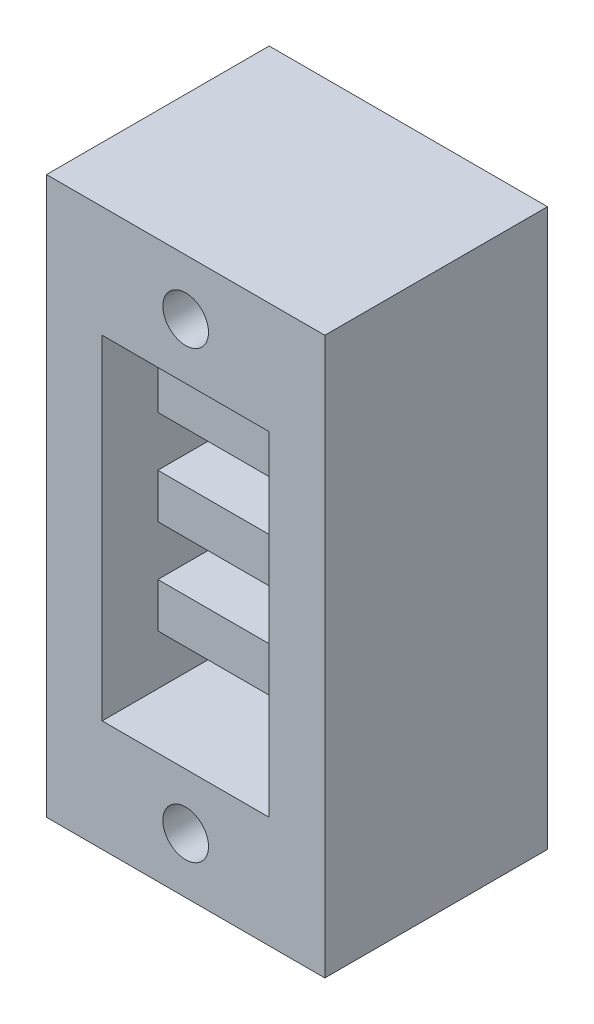
ISO-10303-21;
HEADER;
FILE_DESCRIPTION(('STEP AP214'),'2;1');
FILE_NAME('part.step','',(''),(''),'','','');
FILE_SCHEMA(('AUTOMOTIVE_DESIGN { 1 0 10303 214 1 1 1 1 }'));
ENDSEC;
DATA;
#1=APPLICATION_CONTEXT('core data for automotive mechanical design processes');
#2=APPLICATION_PROTOCOL_DEFINITION('international standard','automotive_design',2000,#1);
#3=PRODUCT_CONTEXT('',#1,'mechanical');
#4=PRODUCT('Part','Part','',(#3));
#5=PRODUCT_RELATED_PRODUCT_CATEGORY('part','',(#4));
#6=PRODUCT_DEFINITION_FORMATION('','',#4);
#7=PRODUCT_DEFINITION_CONTEXT('part definition',#1,'design');
#8=PRODUCT_DEFINITION('design','',#6,#7);
#9=PRODUCT_DEFINITION_SHAPE('','',#8);
#10=(LENGTH_UNIT() NAMED_UNIT(*) SI_UNIT(.MILLI.,.METRE.));
#11=(NAMED_UNIT(*) PLANE_ANGLE_UNIT() SI_UNIT($,.RADIAN.));
#12=(NAMED_UNIT(*) SI_UNIT($,.STERADIAN.) SOLID_ANGLE_UNIT());
#13=UNCERTAINTY_MEASURE_WITH_UNIT(LENGTH_MEASURE(1.E-05),#10,'distance_accuracy_value','');
#14=(GEOMETRIC_REPRESENTATION_CONTEXT(3) GLOBAL_UNCERTAINTY_ASSIGNED_CONTEXT((#13)) GLOBAL_UNIT_ASSIGNED_CONTEXT((#10,
#11,#12)) REPRESENTATION_CONTEXT('',''));
#15=CARTESIAN_POINT('',(0.,0.,0.));
#16=DIRECTION('',(0.,0.,1.));
#17=DIRECTION('',(1.,0.,0.));
#18=AXIS2_PLACEMENT_3D('',#15,#16,#17);
#19=CARTESIAN_POINT('',(-3.81,5.08,-22.1188379885484));
#20=DIRECTION('',(-1.,0.,0.));
#21=DIRECTION('',(0.,0.,1.));
#22=AXIS2_PLACEMENT_3D('',#19,#20,#21);
#23=PLANE('',#22);
#24=DIRECTION('',(0.,0.,1.));
#25=VECTOR('',#24,1.);
#26=CARTESIAN_POINT('',(-3.81,16.002,-2.54));
#27=LINE('',#26,#25);
#28=CARTESIAN_POINT('',(-3.81,16.002,-2.54));
#29=VERTEX_POINT('',#28);
#30=CARTESIAN_POINT('',(-3.81,16.002,2.54));
#31=VERTEX_POINT('',#30);
#32=EDGE_CURVE('E239',#29,#31,#27,.T.);
#33=ORIENTED_EDGE('',*,*,#32,.T.);
#34=DIRECTION('',(0.,1.,0.));
#35=VECTOR('',#34,1.);
#36=CARTESIAN_POINT('',(-3.81,16.002,2.54));
#37=LINE('',#36,#35);
#38=CARTESIAN_POINT('',(-3.81,18.034,2.54));
#39=VERTEX_POINT('',#38);
#40=EDGE_CURVE('E234',#31,#39,#37,.T.);
#41=ORIENTED_EDGE('',*,*,#40,.T.);
#42=DIRECTION('',(0.,0.,-1.));
#43=VECTOR('',#42,1.);
#44=CARTESIAN_POINT('',(-3.81,18.034,-2.54));
#45=LINE('',#44,#43);
#46=CARTESIAN_POINT('',(-3.81,18.034,-2.54));
#47=VERTEX_POINT('',#46);
#48=EDGE_CURVE('E222',#39,#47,#45,.T.);
#49=ORIENTED_EDGE('',*,*,#48,.T.);
#50=DIRECTION('',(0.,1.,0.));
#51=VECTOR('',#50,1.);
#52=CARTESIAN_POINT('',(-3.81,5.08,-2.54));
#53=LINE('',#52,#51);
#54=CARTESIAN_POINT('',(-3.81,20.32,-2.54));
#55=VERTEX_POINT('',#54);
#56=EDGE_CURVE('E330',#47,#55,#53,.T.);
#57=ORIENTED_EDGE('',*,*,#56,.T.);
#58=DIRECTION('',(0.,0.,1.));
#59=VECTOR('',#58,1.);
#60=CARTESIAN_POINT('',(-3.81,20.32,-22.1188379885484));
#61=LINE('',#60,#59);
#62=CARTESIAN_POINT('',(-3.81,20.32,5.08));
#63=VERTEX_POINT('',#62);
#64=EDGE_CURVE('E347',#55,#63,#61,.T.);
#65=ORIENTED_EDGE('',*,*,#64,.T.);
#66=DIRECTION('',(0.,-1.,0.));
#67=VECTOR('',#66,1.);
#68=CARTESIAN_POINT('',(-3.81,5.08,5.08));
#69=LINE('',#68,#67);
#70=CARTESIAN_POINT('',(-3.81,5.08,5.08));
#71=VERTEX_POINT('',#70);
#72=EDGE_CURVE('E187',#63,#71,#69,.T.);
#73=ORIENTED_EDGE('',*,*,#72,.T.);
#74=DIRECTION('',(0.,0.,1.));
#75=VECTOR('',#74,1.);
#76=CARTESIAN_POINT('',(-3.81,5.08,-22.1188379885484));
#77=LINE('',#76,#75);
#78=CARTESIAN_POINT('',(-3.81,5.08,-5.08));
#79=VERTEX_POINT('',#78);
#80=EDGE_CURVE('E180',#79,#71,#77,.T.);
#81=ORIENTED_EDGE('',*,*,#80,.F.);
#82=DIRECTION('',(0.,-1.,0.));
#83=VECTOR('',#82,1.);
#84=CARTESIAN_POINT('',(-3.81,7.366,-5.08));
#85=LINE('',#84,#83);
#86=CARTESIAN_POINT('',(-3.81,7.366,-5.08));
#87=VERTEX_POINT('',#86);
#88=EDGE_CURVE('E184',#87,#79,#85,.T.);
#89=ORIENTED_EDGE('',*,*,#88,.F.);
#90=DIRECTION('',(0.,0.,1.));
#91=VECTOR('',#90,1.);
#92=CARTESIAN_POINT('',(-3.81,7.366,-2.54));
#93=LINE('',#92,#91);
#94=CARTESIAN_POINT('',(-3.81,7.366,2.54));
#95=VERTEX_POINT('',#94);
#96=EDGE_CURVE('E272',#87,#95,#93,.T.);
#97=ORIENTED_EDGE('',*,*,#96,.T.);
#98=DIRECTION('',(0.,1.,0.));
#99=VECTOR('',#98,1.);
#100=CARTESIAN_POINT('',(-3.81,9.398,2.54));
#101=LINE('',#100,#99);
#102=CARTESIAN_POINT('',(-3.81,9.398,2.54));
#103=VERTEX_POINT('',#102);
#104=EDGE_CURVE('E267',#95,#103,#101,.T.);
#105=ORIENTED_EDGE('',*,*,#104,.T.);
#106=DIRECTION('',(0.,0.,-1.));
#107=VECTOR('',#106,1.);
#108=CARTESIAN_POINT('',(-3.81,9.398,-2.54));
#109=LINE('',#108,#107);
#110=CARTESIAN_POINT('',(-3.81,9.398,-2.54));
#111=VERTEX_POINT('',#110);
#112=EDGE_CURVE('E256',#103,#111,#109,.T.);
#113=ORIENTED_EDGE('',*,*,#112,.T.);
#114=CARTESIAN_POINT('',(-3.81,11.684,-2.54));
#115=VERTEX_POINT('',#114);
#116=EDGE_CURVE('E334',#111,#115,#53,.T.);
#117=ORIENTED_EDGE('',*,*,#116,.T.);
#118=DIRECTION('',(0.,0.,1.));
#119=VECTOR('',#118,1.);
#120=CARTESIAN_POINT('',(-3.81,11.684,-2.54));
#121=LINE('',#120,#119);
#122=CARTESIAN_POINT('',(-3.81,11.684,2.54));
#123=VERTEX_POINT('',#122);
#124=EDGE_CURVE('E305',#115,#123,#121,.T.);
#125=ORIENTED_EDGE('',*,*,#124,.T.);
#126=DIRECTION('',(0.,1.,0.));
#127=VECTOR('',#126,1.);
#128=CARTESIAN_POINT('',(-3.81,13.716,2.54));
#129=LINE('',#128,#127);
#130=CARTESIAN_POINT('',(-3.81,13.716,2.54));
#131=VERTEX_POINT('',#130);
#132=EDGE_CURVE('E301',#123,#131,#129,.T.);
#133=ORIENTED_EDGE('',*,*,#132,.T.);
#134=DIRECTION('',(0.,0.,-1.));
#135=VECTOR('',#134,1.);
#136=CARTESIAN_POINT('',(-3.81,13.716,-2.54));
#137=LINE('',#136,#135);
#138=CARTESIAN_POINT('',(-3.81,13.716,-2.54));
#139=VERTEX_POINT('',#138);
#140=EDGE_CURVE('E289',#131,#139,#137,.T.);
#141=ORIENTED_EDGE('',*,*,#140,.T.);
#142=EDGE_CURVE('E333',#139,#29,#53,.T.);
#143=ORIENTED_EDGE('',*,*,#142,.T.);
#144=EDGE_LOOP('',(#33,#41,#49,#57,#65,#73,#81,#89,#97,#105,#113,#117,#125,#133,#141,#143));
#145=FACE_BOUND('',#144,.T.);
#146=ADVANCED_FACE('F41',(#145),#23,.F.);
#147=CARTESIAN_POINT('',(3.81,5.08,-22.1188379885484));
#148=DIRECTION('',(1.,0.,0.));
#149=DIRECTION('',(0.,0.,-1.));
#150=AXIS2_PLACEMENT_3D('',#147,#148,#149);
#151=PLANE('',#150);
#152=DIRECTION('',(0.,0.,1.));
#153=VECTOR('',#152,1.);
#154=CARTESIAN_POINT('',(3.81,16.002,-2.54));
#155=LINE('',#154,#153);
#156=CARTESIAN_POINT('',(3.81,16.002,-2.54));
#157=VERTEX_POINT('',#156);
#158=CARTESIAN_POINT('',(3.81,16.002,2.54));
#159=VERTEX_POINT('',#158);
#160=EDGE_CURVE('E229',#157,#159,#155,.T.);
#161=ORIENTED_EDGE('',*,*,#160,.F.);
#162=DIRECTION('',(0.,-1.,0.));
#163=VECTOR('',#162,1.);
#164=CARTESIAN_POINT('',(3.81,5.08,-2.54));
#165=LINE('',#164,#163);
#166=CARTESIAN_POINT('',(3.81,13.716,-2.54));
#167=VERTEX_POINT('',#166);
#168=EDGE_CURVE('E326',#157,#167,#165,.T.);
#169=ORIENTED_EDGE('',*,*,#168,.T.);
#170=DIRECTION('',(0.,0.,-1.));
#171=VECTOR('',#170,1.);
#172=CARTESIAN_POINT('',(3.81,13.716,-2.54));
#173=LINE('',#172,#171);
#174=CARTESIAN_POINT('',(3.81,13.716,2.54));
#175=VERTEX_POINT('',#174);
#176=EDGE_CURVE('E285',#175,#167,#173,.T.);
#177=ORIENTED_EDGE('',*,*,#176,.F.);
#178=DIRECTION('',(0.,1.,0.));
#179=VECTOR('',#178,1.);
#180=CARTESIAN_POINT('',(3.81,13.716,2.54));
#181=LINE('',#180,#179);
#182=CARTESIAN_POINT('',(3.81,11.684,2.54));
#183=VERTEX_POINT('',#182);
#184=EDGE_CURVE('E291',#183,#175,#181,.T.);
#185=ORIENTED_EDGE('',*,*,#184,.F.);
#186=DIRECTION('',(0.,0.,1.));
#187=VECTOR('',#186,1.);
#188=CARTESIAN_POINT('',(3.81,11.684,-2.54));
#189=LINE('',#188,#187);
#190=CARTESIAN_POINT('',(3.81,11.684,-2.54));
#191=VERTEX_POINT('',#190);
#192=EDGE_CURVE('E296',#191,#183,#189,.T.);
#193=ORIENTED_EDGE('',*,*,#192,.F.);
#194=CARTESIAN_POINT('',(3.81,9.398,-2.54));
#195=VERTEX_POINT('',#194);
#196=EDGE_CURVE('E327',#191,#195,#165,.T.);
#197=ORIENTED_EDGE('',*,*,#196,.T.);
#198=DIRECTION('',(0.,0.,-1.));
#199=VECTOR('',#198,1.);
#200=CARTESIAN_POINT('',(3.81,9.398,-2.54));
#201=LINE('',#200,#199);
#202=CARTESIAN_POINT('',(3.81,9.398,2.54));
#203=VERTEX_POINT('',#202);
#204=EDGE_CURVE('E253',#203,#195,#201,.T.);
#205=ORIENTED_EDGE('',*,*,#204,.F.);
#206=DIRECTION('',(0.,1.,0.));
#207=VECTOR('',#206,1.);
#208=CARTESIAN_POINT('',(3.81,9.398,2.54));
#209=LINE('',#208,#207);
#210=CARTESIAN_POINT('',(3.81,7.366,2.54));
#211=VERTEX_POINT('',#210);
#212=EDGE_CURVE('E258',#211,#203,#209,.T.);
#213=ORIENTED_EDGE('',*,*,#212,.F.);
#214=DIRECTION('',(0.,0.,1.));
#215=VECTOR('',#214,1.);
#216=CARTESIAN_POINT('',(3.81,7.366,-2.54));
#217=LINE('',#216,#215);
#218=CARTESIAN_POINT('',(3.81,7.366,-5.08));
#219=VERTEX_POINT('',#218);
#220=EDGE_CURVE('E263',#219,#211,#217,.T.);
#221=ORIENTED_EDGE('',*,*,#220,.F.);
#222=DIRECTION('',(0.,1.,0.));
#223=VECTOR('',#222,1.);
#224=CARTESIAN_POINT('',(3.81,7.366,-5.08));
#225=LINE('',#224,#223);
#226=CARTESIAN_POINT('',(3.81,5.08,-5.08));
#227=VERTEX_POINT('',#226);
#228=EDGE_CURVE('E198',#227,#219,#225,.T.);
#229=ORIENTED_EDGE('',*,*,#228,.F.);
#230=DIRECTION('',(0.,0.,1.));
#231=VECTOR('',#230,1.);
#232=CARTESIAN_POINT('',(3.81,5.08,-22.1188379885484));
#233=LINE('',#232,#231);
#234=CARTESIAN_POINT('',(3.81,5.08,5.08));
#235=VERTEX_POINT('',#234);
#236=EDGE_CURVE('E57',#227,#235,#233,.T.);
#237=ORIENTED_EDGE('',*,*,#236,.T.);
#238=DIRECTION('',(0.,1.,0.));
#239=VECTOR('',#238,1.);
#240=CARTESIAN_POINT('',(3.81,5.08,5.08));
#241=LINE('',#240,#239);
#242=CARTESIAN_POINT('',(3.81,20.32,5.08));
#243=VERTEX_POINT('',#242);
#244=EDGE_CURVE('E340',#235,#243,#241,.T.);
#245=ORIENTED_EDGE('',*,*,#244,.T.);
#246=DIRECTION('',(0.,0.,1.));
#247=VECTOR('',#246,1.);
#248=CARTESIAN_POINT('',(3.81,20.32,-22.1188379885484));
#249=LINE('',#248,#247);
#250=CARTESIAN_POINT('',(3.81,20.32,-2.54));
#251=VERTEX_POINT('',#250);
#252=EDGE_CURVE('E350',#251,#243,#249,.T.);
#253=ORIENTED_EDGE('',*,*,#252,.F.);
#254=CARTESIAN_POINT('',(3.81,18.034,-2.54));
#255=VERTEX_POINT('',#254);
#256=EDGE_CURVE('E321',#251,#255,#165,.T.);
#257=ORIENTED_EDGE('',*,*,#256,.T.);
#258=DIRECTION('',(0.,0.,-1.));
#259=VECTOR('',#258,1.);
#260=CARTESIAN_POINT('',(3.81,18.034,-2.54));
#261=LINE('',#260,#259);
#262=CARTESIAN_POINT('',(3.81,18.034,2.54));
#263=VERTEX_POINT('',#262);
#264=EDGE_CURVE('E65',#263,#255,#261,.T.);
#265=ORIENTED_EDGE('',*,*,#264,.F.);
#266=DIRECTION('',(0.,1.,0.));
#267=VECTOR('',#266,1.);
#268=CARTESIAN_POINT('',(3.81,16.002,2.54));
#269=LINE('',#268,#267);
#270=EDGE_CURVE('E224',#159,#263,#269,.T.);
#271=ORIENTED_EDGE('',*,*,#270,.F.);
#272=EDGE_LOOP('',(#161,#169,#177,#185,#193,#197,#205,#213,#221,#229,#237,#245,#253,#257,#265,#271));
#273=FACE_BOUND('',#272,.T.);
#274=ADVANCED_FACE('F419',(#273),#151,.F.);
#275=CARTESIAN_POINT('',(-6.35,25.4,-2.54));
#276=DIRECTION('',(0.,0.,1.));
#277=DIRECTION('',(1.,0.,0.));
#278=AXIS2_PLACEMENT_3D('',#275,#276,#277);
#279=PLANE('',#278);
#280=ORIENTED_EDGE('',*,*,#168,.F.);
#281=DIRECTION('',(1.,0.,0.));
#282=VECTOR('',#281,1.);
#283=CARTESIAN_POINT('',(-9.28132744404866,16.002,-2.54));
#284=LINE('',#283,#282);
#285=EDGE_CURVE('E233',#29,#157,#284,.T.);
#286=ORIENTED_EDGE('',*,*,#285,.F.);
#287=ORIENTED_EDGE('',*,*,#142,.F.);
#288=DIRECTION('',(1.,0.,0.));
#289=VECTOR('',#288,1.);
#290=CARTESIAN_POINT('',(-9.28132744404866,13.716,-2.54));
#291=LINE('',#290,#289);
#292=EDGE_CURVE('E271',#139,#167,#291,.T.);
#293=ORIENTED_EDGE('',*,*,#292,.T.);
#294=EDGE_LOOP('',(#280,#286,#287,#293));
#295=FACE_BOUND('',#294,.T.);
#296=ADVANCED_FACE('F424',(#295),#279,.T.);
#297=ORIENTED_EDGE('',*,*,#56,.F.);
#298=DIRECTION('',(1.,0.,0.));
#299=VECTOR('',#298,1.);
#300=CARTESIAN_POINT('',(-9.28132744404866,18.034,-2.54));
#301=LINE('',#300,#299);
#302=EDGE_CURVE('E219',#47,#255,#301,.T.);
#303=ORIENTED_EDGE('',*,*,#302,.T.);
#304=ORIENTED_EDGE('',*,*,#256,.F.);
#305=DIRECTION('',(1.,0.,0.));
#306=VECTOR('',#305,1.);
#307=CARTESIAN_POINT('',(-3.81,20.32,-2.54));
#308=LINE('',#307,#306);
#309=EDGE_CURVE('E325',#55,#251,#308,.T.);
#310=ORIENTED_EDGE('',*,*,#309,.F.);
#311=EDGE_LOOP('',(#297,#303,#304,#310));
#312=FACE_BOUND('',#311,.T.);
#313=ADVANCED_FACE('F497',(#312),#279,.T.);
#314=ORIENTED_EDGE('',*,*,#116,.F.);
#315=DIRECTION('',(1.,0.,0.));
#316=VECTOR('',#315,1.);
#317=CARTESIAN_POINT('',(-9.28132744404866,9.398,-2.54));
#318=LINE('',#317,#316);
#319=EDGE_CURVE('E238',#111,#195,#318,.T.);
#320=ORIENTED_EDGE('',*,*,#319,.T.);
#321=ORIENTED_EDGE('',*,*,#196,.F.);
#322=DIRECTION('',(1.,0.,0.));
#323=VECTOR('',#322,1.);
#324=CARTESIAN_POINT('',(-9.28132744404866,11.684,-2.54));
#325=LINE('',#324,#323);
#326=EDGE_CURVE('E300',#115,#191,#325,.T.);
#327=ORIENTED_EDGE('',*,*,#326,.F.);
#328=EDGE_LOOP('',(#314,#320,#321,#327));
#329=FACE_BOUND('',#328,.T.);
#330=ADVANCED_FACE('F416',(#329),#279,.T.);
#331=CARTESIAN_POINT('',(6.35,25.4,5.08));
#332=DIRECTION('',(-1.,0.,0.));
#333=DIRECTION('',(0.,0.,1.));
#334=AXIS2_PLACEMENT_3D('',#331,#332,#333);
#335=PLANE('',#334);
#336=DIRECTION('',(0.,0.,-1.));
#337=VECTOR('',#336,1.);
#338=CARTESIAN_POINT('',(6.35,0.,5.08));
#339=LINE('',#338,#337);
#340=CARTESIAN_POINT('',(6.35,0.,5.08));
#341=VERTEX_POINT('',#340);
#342=CARTESIAN_POINT('',(6.35,0.,-5.08));
#343=VERTEX_POINT('',#342);
#344=EDGE_CURVE('E370',#341,#343,#339,.T.);
#345=ORIENTED_EDGE('',*,*,#344,.T.);
#346=DIRECTION('',(0.,-1.,0.));
#347=VECTOR('',#346,1.);
#348=CARTESIAN_POINT('',(6.35,25.4,-5.08));
#349=LINE('',#348,#347);
#350=CARTESIAN_POINT('',(6.35,25.4,-5.08));
#351=VERTEX_POINT('',#350);
#352=EDGE_CURVE('E12',#351,#343,#349,.T.);
#353=ORIENTED_EDGE('',*,*,#352,.F.);
#354=DIRECTION('',(0.,0.,-1.));
#355=VECTOR('',#354,1.);
#356=CARTESIAN_POINT('',(6.35,25.4,5.08));
#357=LINE('',#356,#355);
#358=CARTESIAN_POINT('',(6.35,25.4,5.08));
#359=VERTEX_POINT('',#358);
#360=EDGE_CURVE('E355',#359,#351,#357,.T.);
#361=ORIENTED_EDGE('',*,*,#360,.F.);
#362=DIRECTION('',(0.,-1.,0.));
#363=VECTOR('',#362,1.);
#364=CARTESIAN_POINT('',(6.35,25.4,5.08));
#365=LINE('',#364,#363);
#366=EDGE_CURVE('E369',#359,#341,#365,.T.);
#367=ORIENTED_EDGE('',*,*,#366,.T.);
#368=EDGE_LOOP('',(#345,#353,#361,#367));
#369=FACE_BOUND('',#368,.T.);
#370=ADVANCED_FACE('F43',(#369),#335,.F.);
#371=CARTESIAN_POINT('',(-6.35,25.4,-5.08));
#372=DIRECTION('',(0.,0.,1.));
#373=DIRECTION('',(1.,0.,0.));
#374=AXIS2_PLACEMENT_3D('',#371,#372,#373);
#375=PLANE('',#374);
#376=CARTESIAN_POINT('',(0.,22.86,-5.08));
#377=DIRECTION('',(0.,0.,1.));
#378=DIRECTION('',(1.,0.,0.));
#379=AXIS2_PLACEMENT_3D('',#376,#377,#378);
#380=CIRCLE('',#379,1.0414);
#381=CARTESIAN_POINT('',(1.0414,22.86,-5.08));
#382=VERTEX_POINT('',#381);
#383=EDGE_CURVE('E205',#382,#382,#380,.T.);
#384=ORIENTED_EDGE('',*,*,#383,.T.);
#385=EDGE_LOOP('',(#384));
#386=FACE_BOUND('',#385,.T.);
#387=CARTESIAN_POINT('',(0.,2.54,-5.08));
#388=DIRECTION('',(0.,0.,1.));
#389=DIRECTION('',(1.,0.,0.));
#390=AXIS2_PLACEMENT_3D('',#387,#388,#389);
#391=CIRCLE('',#390,1.0414);
#392=CARTESIAN_POINT('',(1.0414,2.54,-5.08));
#393=VERTEX_POINT('',#392);
#394=EDGE_CURVE('E628',#393,#393,#391,.T.);
#395=ORIENTED_EDGE('',*,*,#394,.T.);
#396=EDGE_LOOP('',(#395));
#397=FACE_BOUND('',#396,.T.);
#398=DIRECTION('',(-1.,0.,0.));
#399=VECTOR('',#398,1.);
#400=CARTESIAN_POINT('',(-3.81,7.366,-5.08));
#401=LINE('',#400,#399);
#402=EDGE_CURVE('E203',#219,#87,#401,.T.);
#403=ORIENTED_EDGE('',*,*,#402,.T.);
#404=ORIENTED_EDGE('',*,*,#88,.T.);
#405=DIRECTION('',(1.,0.,0.));
#406=VECTOR('',#405,1.);
#407=CARTESIAN_POINT('',(-3.81,5.08,-5.08));
#408=LINE('',#407,#406);
#409=EDGE_CURVE('E193',#79,#227,#408,.T.);
#410=ORIENTED_EDGE('',*,*,#409,.T.);
#411=ORIENTED_EDGE('',*,*,#228,.T.);
#412=EDGE_LOOP('',(#403,#404,#410,#411));
#413=FACE_BOUND('',#412,.T.);
#414=DIRECTION('',(-1.,0.,0.));
#415=VECTOR('',#414,1.);
#416=CARTESIAN_POINT('',(-6.35,0.,-5.08));
#417=LINE('',#416,#415);
#418=CARTESIAN_POINT('',(-6.35,0.,-5.08));
#419=VERTEX_POINT('',#418);
#420=EDGE_CURVE('E374',#343,#419,#417,.T.);
#421=ORIENTED_EDGE('',*,*,#420,.T.);
#422=DIRECTION('',(0.,-1.,0.));
#423=VECTOR('',#422,1.);
#424=CARTESIAN_POINT('',(-6.35,25.4,-5.08));
#425=LINE('',#424,#423);
#426=CARTESIAN_POINT('',(-6.35,25.4,-5.08));
#427=VERTEX_POINT('',#426);
#428=EDGE_CURVE('E50',#427,#419,#425,.T.);
#429=ORIENTED_EDGE('',*,*,#428,.F.);
#430=DIRECTION('',(-1.,0.,0.));
#431=VECTOR('',#430,1.);
#432=CARTESIAN_POINT('',(-6.35,25.4,-5.08));
#433=LINE('',#432,#431);
#434=EDGE_CURVE('E359',#351,#427,#433,.T.);
#435=ORIENTED_EDGE('',*,*,#434,.F.);
#436=ORIENTED_EDGE('',*,*,#352,.T.);
#437=EDGE_LOOP('',(#421,#429,#435,#436));
#438=FACE_BOUND('',#437,.T.);
#439=ADVANCED_FACE('F200',(#386,#397,#413,#438),#375,.F.);
#440=CARTESIAN_POINT('',(-6.35,25.4,5.08));
#441=DIRECTION('',(1.,0.,0.));
#442=DIRECTION('',(0.,0.,-1.));
#443=AXIS2_PLACEMENT_3D('',#440,#441,#442);
#444=PLANE('',#443);
#445=DIRECTION('',(0.,0.,1.));
#446=VECTOR('',#445,1.);
#447=CARTESIAN_POINT('',(-6.35,0.,5.08));
#448=LINE('',#447,#446);
#449=CARTESIAN_POINT('',(-6.35,0.,5.08));
#450=VERTEX_POINT('',#449);
#451=EDGE_CURVE('E377',#419,#450,#448,.T.);
#452=ORIENTED_EDGE('',*,*,#451,.T.);
#453=DIRECTION('',(0.,-1.,0.));
#454=VECTOR('',#453,1.);
#455=CARTESIAN_POINT('',(-6.35,25.4,5.08));
#456=LINE('',#455,#454);
#457=CARTESIAN_POINT('',(-6.35,25.4,5.08));
#458=VERTEX_POINT('',#457);
#459=EDGE_CURVE('E385',#458,#450,#456,.T.);
#460=ORIENTED_EDGE('',*,*,#459,.F.);
#461=DIRECTION('',(0.,0.,1.));
#462=VECTOR('',#461,1.);
#463=CARTESIAN_POINT('',(-6.35,25.4,5.08));
#464=LINE('',#463,#462);
#465=EDGE_CURVE('E363',#427,#458,#464,.T.);
#466=ORIENTED_EDGE('',*,*,#465,.F.);
#467=ORIENTED_EDGE('',*,*,#428,.T.);
#468=EDGE_LOOP('',(#452,#460,#466,#467));
#469=FACE_BOUND('',#468,.T.);
#470=ADVANCED_FACE('F394',(#469),#444,.F.);
#471=CARTESIAN_POINT('',(-6.35,25.4,5.08));
#472=DIRECTION('',(0.,0.,-1.));
#473=DIRECTION('',(-1.,0.,0.));
#474=AXIS2_PLACEMENT_3D('',#471,#472,#473);
#475=PLANE('',#474);
#476=CARTESIAN_POINT('',(0.,22.86,5.08));
#477=DIRECTION('',(0.,0.,1.));
#478=DIRECTION('',(1.,0.,0.));
#479=AXIS2_PLACEMENT_3D('',#476,#477,#478);
#480=CIRCLE('',#479,1.0414);
#481=CARTESIAN_POINT('',(1.0414,22.86,5.08));
#482=VERTEX_POINT('',#481);
#483=EDGE_CURVE('E209',#482,#482,#480,.T.);
#484=ORIENTED_EDGE('',*,*,#483,.F.);
#485=EDGE_LOOP('',(#484));
#486=FACE_BOUND('',#485,.T.);
#487=CARTESIAN_POINT('',(0.,2.54,5.08));
#488=DIRECTION('',(0.,0.,1.));
#489=DIRECTION('',(1.,0.,0.));
#490=AXIS2_PLACEMENT_3D('',#487,#488,#489);
#491=CIRCLE('',#490,1.0414);
#492=CARTESIAN_POINT('',(1.0414,2.54,5.08));
#493=VERTEX_POINT('',#492);
#494=EDGE_CURVE('E212',#493,#493,#491,.T.);
#495=ORIENTED_EDGE('',*,*,#494,.F.);
#496=EDGE_LOOP('',(#495));
#497=FACE_BOUND('',#496,.T.);
#498=DIRECTION('',(1.,0.,0.));
#499=VECTOR('',#498,1.);
#500=CARTESIAN_POINT('',(-3.81,5.08,5.08));
#501=LINE('',#500,#499);
#502=EDGE_CURVE('E337',#71,#235,#501,.T.);
#503=ORIENTED_EDGE('',*,*,#502,.F.);
#504=ORIENTED_EDGE('',*,*,#72,.F.);
#505=DIRECTION('',(-1.,0.,0.));
#506=VECTOR('',#505,1.);
#507=CARTESIAN_POINT('',(-3.81,20.32,5.08));
#508=LINE('',#507,#506);
#509=EDGE_CURVE('E190',#243,#63,#508,.T.);
#510=ORIENTED_EDGE('',*,*,#509,.F.);
#511=ORIENTED_EDGE('',*,*,#244,.F.);
#512=EDGE_LOOP('',(#503,#504,#510,#511));
#513=FACE_BOUND('',#512,.T.);
#514=DIRECTION('',(1.,0.,0.));
#515=VECTOR('',#514,1.);
#516=CARTESIAN_POINT('',(-6.35,0.,5.08));
#517=LINE('',#516,#515);
#518=EDGE_CURVE('E360',#450,#341,#517,.T.);
#519=ORIENTED_EDGE('',*,*,#518,.T.);
#520=ORIENTED_EDGE('',*,*,#366,.F.);
#521=DIRECTION('',(1.,0.,0.));
#522=VECTOR('',#521,1.);
#523=CARTESIAN_POINT('',(-6.35,25.4,5.08));
#524=LINE('',#523,#522);
#525=EDGE_CURVE('E366',#458,#359,#524,.T.);
#526=ORIENTED_EDGE('',*,*,#525,.F.);
#527=ORIENTED_EDGE('',*,*,#459,.T.);
#528=EDGE_LOOP('',(#519,#520,#526,#527));
#529=FACE_BOUND('',#528,.T.);
#530=ADVANCED_FACE('F402',(#486,#497,#513,#529),#475,.F.);
#531=CARTESIAN_POINT('',(0.,25.4,0.));
#532=DIRECTION('',(0.,-1.,0.));
#533=DIRECTION('',(0.,0.,-1.));
#534=AXIS2_PLACEMENT_3D('',#531,#532,#533);
#535=PLANE('',#534);
#536=ORIENTED_EDGE('',*,*,#360,.T.);
#537=ORIENTED_EDGE('',*,*,#434,.T.);
#538=ORIENTED_EDGE('',*,*,#465,.T.);
#539=ORIENTED_EDGE('',*,*,#525,.T.);
#540=EDGE_LOOP('',(#536,#537,#538,#539));
#541=FACE_BOUND('',#540,.T.);
#542=ADVANCED_FACE('F408',(#541),#535,.F.);
#543=CARTESIAN_POINT('',(0.,0.,0.));
#544=DIRECTION('',(0.,-1.,0.));
#545=DIRECTION('',(0.,0.,-1.));
#546=AXIS2_PLACEMENT_3D('',#543,#544,#545);
#547=PLANE('',#546);
#548=ORIENTED_EDGE('',*,*,#344,.F.);
#549=ORIENTED_EDGE('',*,*,#518,.F.);
#550=ORIENTED_EDGE('',*,*,#451,.F.);
#551=ORIENTED_EDGE('',*,*,#420,.F.);
#552=EDGE_LOOP('',(#548,#549,#550,#551));
#553=FACE_BOUND('',#552,.T.);
#554=ADVANCED_FACE('F399',(#553),#547,.T.);
#555=CARTESIAN_POINT('',(-3.81,20.32,-22.1188379885484));
#556=DIRECTION('',(0.,1.,0.));
#557=DIRECTION('',(0.,0.,1.));
#558=AXIS2_PLACEMENT_3D('',#555,#556,#557);
#559=PLANE('',#558);
#560=ORIENTED_EDGE('',*,*,#309,.T.);
#561=ORIENTED_EDGE('',*,*,#252,.T.);
#562=ORIENTED_EDGE('',*,*,#509,.T.);
#563=ORIENTED_EDGE('',*,*,#64,.F.);
#564=EDGE_LOOP('',(#560,#561,#562,#563));
#565=FACE_BOUND('',#564,.T.);
#566=ADVANCED_FACE('F433',(#565),#559,.F.);
#567=CARTESIAN_POINT('',(-3.81,5.08,-22.1188379885484));
#568=DIRECTION('',(0.,-1.,0.));
#569=DIRECTION('',(0.,0.,-1.));
#570=AXIS2_PLACEMENT_3D('',#567,#568,#569);
#571=PLANE('',#570);
#572=ORIENTED_EDGE('',*,*,#236,.F.);
#573=ORIENTED_EDGE('',*,*,#409,.F.);
#574=ORIENTED_EDGE('',*,*,#80,.T.);
#575=ORIENTED_EDGE('',*,*,#502,.T.);
#576=EDGE_LOOP('',(#572,#573,#574,#575));
#577=FACE_BOUND('',#576,.T.);
#578=ADVANCED_FACE('F194',(#577),#571,.F.);
#579=CARTESIAN_POINT('',(-9.28132744404866,11.684,-2.54));
#580=DIRECTION('',(0.,1.,0.));
#581=DIRECTION('',(0.,0.,1.));
#582=AXIS2_PLACEMENT_3D('',#579,#580,#581);
#583=PLANE('',#582);
#584=ORIENTED_EDGE('',*,*,#124,.F.);
#585=ORIENTED_EDGE('',*,*,#326,.T.);
#586=ORIENTED_EDGE('',*,*,#192,.T.);
#587=DIRECTION('',(1.,0.,0.));
#588=VECTOR('',#587,1.);
#589=CARTESIAN_POINT('',(-9.28132744404866,11.684,2.54));
#590=LINE('',#589,#588);
#591=EDGE_CURVE('E295',#123,#183,#590,.T.);
#592=ORIENTED_EDGE('',*,*,#591,.F.);
#593=EDGE_LOOP('',(#584,#585,#586,#592));
#594=FACE_BOUND('',#593,.T.);
#595=ADVANCED_FACE('F482',(#594),#583,.F.);
#596=CARTESIAN_POINT('',(-9.28132744404866,13.716,2.54));
#597=DIRECTION('',(0.,0.,-1.));
#598=DIRECTION('',(-1.,0.,0.));
#599=AXIS2_PLACEMENT_3D('',#596,#597,#598);
#600=PLANE('',#599);
#601=ORIENTED_EDGE('',*,*,#132,.F.);
#602=ORIENTED_EDGE('',*,*,#591,.T.);
#603=ORIENTED_EDGE('',*,*,#184,.T.);
#604=DIRECTION('',(1.,0.,0.));
#605=VECTOR('',#604,1.);
#606=CARTESIAN_POINT('',(-9.28132744404866,13.716,2.54));
#607=LINE('',#606,#605);
#608=EDGE_CURVE('E290',#131,#175,#607,.T.);
#609=ORIENTED_EDGE('',*,*,#608,.F.);
#610=EDGE_LOOP('',(#601,#602,#603,#609));
#611=FACE_BOUND('',#610,.T.);
#612=ADVANCED_FACE('F484',(#611),#600,.F.);
#613=CARTESIAN_POINT('',(-9.28132744404866,13.716,-2.54));
#614=DIRECTION('',(0.,-1.,0.));
#615=DIRECTION('',(0.,0.,-1.));
#616=AXIS2_PLACEMENT_3D('',#613,#614,#615);
#617=PLANE('',#616);
#618=ORIENTED_EDGE('',*,*,#140,.F.);
#619=ORIENTED_EDGE('',*,*,#608,.T.);
#620=ORIENTED_EDGE('',*,*,#176,.T.);
#621=ORIENTED_EDGE('',*,*,#292,.F.);
#622=EDGE_LOOP('',(#618,#619,#620,#621));
#623=FACE_BOUND('',#622,.T.);
#624=ADVANCED_FACE('F474',(#623),#617,.F.);
#625=CARTESIAN_POINT('',(-9.28132744404866,7.366,-2.54));
#626=DIRECTION('',(0.,1.,0.));
#627=DIRECTION('',(0.,0.,1.));
#628=AXIS2_PLACEMENT_3D('',#625,#626,#627);
#629=PLANE('',#628);
#630=ORIENTED_EDGE('',*,*,#96,.F.);
#631=ORIENTED_EDGE('',*,*,#402,.F.);
#632=ORIENTED_EDGE('',*,*,#220,.T.);
#633=DIRECTION('',(1.,0.,0.));
#634=VECTOR('',#633,1.);
#635=CARTESIAN_POINT('',(-9.28132744404866,7.366,2.54));
#636=LINE('',#635,#634);
#637=EDGE_CURVE('E262',#95,#211,#636,.T.);
#638=ORIENTED_EDGE('',*,*,#637,.F.);
#639=EDGE_LOOP('',(#630,#631,#632,#638));
#640=FACE_BOUND('',#639,.T.);
#641=ADVANCED_FACE('F452',(#640),#629,.F.);
#642=CARTESIAN_POINT('',(-9.28132744404866,9.398,2.54));
#643=DIRECTION('',(0.,0.,-1.));
#644=DIRECTION('',(0.,1.,0.));
#645=AXIS2_PLACEMENT_3D('',#642,#643,#644);
#646=PLANE('',#645);
#647=ORIENTED_EDGE('',*,*,#104,.F.);
#648=ORIENTED_EDGE('',*,*,#637,.T.);
#649=ORIENTED_EDGE('',*,*,#212,.T.);
#650=DIRECTION('',(1.,0.,0.));
#651=VECTOR('',#650,1.);
#652=CARTESIAN_POINT('',(-9.28132744404866,9.398,2.54));
#653=LINE('',#652,#651);
#654=EDGE_CURVE('E257',#103,#203,#653,.T.);
#655=ORIENTED_EDGE('',*,*,#654,.F.);
#656=EDGE_LOOP('',(#647,#648,#649,#655));
#657=FACE_BOUND('',#656,.T.);
#658=ADVANCED_FACE('F456',(#657),#646,.F.);
#659=CARTESIAN_POINT('',(-9.28132744404866,9.398,-2.54));
#660=DIRECTION('',(0.,-1.,0.));
#661=DIRECTION('',(0.,0.,-1.));
#662=AXIS2_PLACEMENT_3D('',#659,#660,#661);
#663=PLANE('',#662);
#664=ORIENTED_EDGE('',*,*,#112,.F.);
#665=ORIENTED_EDGE('',*,*,#654,.T.);
#666=ORIENTED_EDGE('',*,*,#204,.T.);
#667=ORIENTED_EDGE('',*,*,#319,.F.);
#668=EDGE_LOOP('',(#664,#665,#666,#667));
#669=FACE_BOUND('',#668,.T.);
#670=ADVANCED_FACE('F458',(#669),#663,.F.);
#671=CARTESIAN_POINT('',(-9.28132744404866,16.002,-2.54));
#672=DIRECTION('',(0.,1.,0.));
#673=DIRECTION('',(0.,0.,1.));
#674=AXIS2_PLACEMENT_3D('',#671,#672,#673);
#675=PLANE('',#674);
#676=ORIENTED_EDGE('',*,*,#32,.F.);
#677=ORIENTED_EDGE('',*,*,#285,.T.);
#678=ORIENTED_EDGE('',*,*,#160,.T.);
#679=DIRECTION('',(1.,0.,0.));
#680=VECTOR('',#679,1.);
#681=CARTESIAN_POINT('',(-9.28132744404866,16.002,2.54));
#682=LINE('',#681,#680);
#683=EDGE_CURVE('E228',#31,#159,#682,.T.);
#684=ORIENTED_EDGE('',*,*,#683,.F.);
#685=EDGE_LOOP('',(#676,#677,#678,#684));
#686=FACE_BOUND('',#685,.T.);
#687=ADVANCED_FACE('F513',(#686),#675,.F.);
#688=CARTESIAN_POINT('',(-9.28132744404866,16.002,2.54));
#689=DIRECTION('',(0.,0.,-1.));
#690=DIRECTION('',(-1.,0.,0.));
#691=AXIS2_PLACEMENT_3D('',#688,#689,#690);
#692=PLANE('',#691);
#693=ORIENTED_EDGE('',*,*,#40,.F.);
#694=ORIENTED_EDGE('',*,*,#683,.T.);
#695=ORIENTED_EDGE('',*,*,#270,.T.);
#696=DIRECTION('',(1.,0.,0.));
#697=VECTOR('',#696,1.);
#698=CARTESIAN_POINT('',(-9.28132744404866,18.034,2.54));
#699=LINE('',#698,#697);
#700=EDGE_CURVE('E223',#39,#263,#699,.T.);
#701=ORIENTED_EDGE('',*,*,#700,.F.);
#702=EDGE_LOOP('',(#693,#694,#695,#701));
#703=FACE_BOUND('',#702,.T.);
#704=ADVANCED_FACE('F509',(#703),#692,.F.);
#705=CARTESIAN_POINT('',(-9.28132744404866,18.034,-2.54));
#706=DIRECTION('',(0.,-1.,0.));
#707=DIRECTION('',(0.,0.,-1.));
#708=AXIS2_PLACEMENT_3D('',#705,#706,#707);
#709=PLANE('',#708);
#710=ORIENTED_EDGE('',*,*,#48,.F.);
#711=ORIENTED_EDGE('',*,*,#700,.T.);
#712=ORIENTED_EDGE('',*,*,#264,.T.);
#713=ORIENTED_EDGE('',*,*,#302,.F.);
#714=EDGE_LOOP('',(#710,#711,#712,#713));
#715=FACE_BOUND('',#714,.T.);
#716=ADVANCED_FACE('F514',(#715),#709,.F.);
#717=CARTESIAN_POINT('',(0.,2.54,-5.08));
#718=DIRECTION('',(0.,0.,1.));
#719=DIRECTION('',(1.,0.,0.));
#720=AXIS2_PLACEMENT_3D('',#717,#718,#719);
#721=CYLINDRICAL_SURFACE('',#720,1.0414);
#722=ORIENTED_EDGE('',*,*,#394,.F.);
#723=EDGE_LOOP('',(#722));
#724=FACE_BOUND('',#723,.T.);
#725=ORIENTED_EDGE('',*,*,#494,.T.);
#726=EDGE_LOOP('',(#725));
#727=FACE_BOUND('',#726,.T.);
#728=ADVANCED_FACE('F516',(#724,#727),#721,.F.);
#729=CARTESIAN_POINT('',(0.,22.86,-5.08));
#730=DIRECTION('',(0.,0.,1.));
#731=DIRECTION('',(1.,0.,0.));
#732=AXIS2_PLACEMENT_3D('',#729,#730,#731);
#733=CYLINDRICAL_SURFACE('',#732,1.0414);
#734=ORIENTED_EDGE('',*,*,#383,.F.);
#735=EDGE_LOOP('',(#734));
#736=FACE_BOUND('',#735,.T.);
#737=ORIENTED_EDGE('',*,*,#483,.T.);
#738=EDGE_LOOP('',(#737));
#739=FACE_BOUND('',#738,.T.);
#740=ADVANCED_FACE('F522',(#736,#739),#733,.F.);
#741=CLOSED_SHELL('',(#146,#274,#296,#313,#330,#370,#439,#470,#530,#542,#554,#566,#578,#595,
#612,#624,#641,#658,#670,#687,#704,#716,#728,#740));
#742=MANIFOLD_SOLID_BREP('B2',#741);
#743=ADVANCED_BREP_SHAPE_REPRESENTATION('',(#18,#742),#14);
#744=SHAPE_DEFINITION_REPRESENTATION(#9,#743);
ENDSEC;
END-ISO-10303-21;
